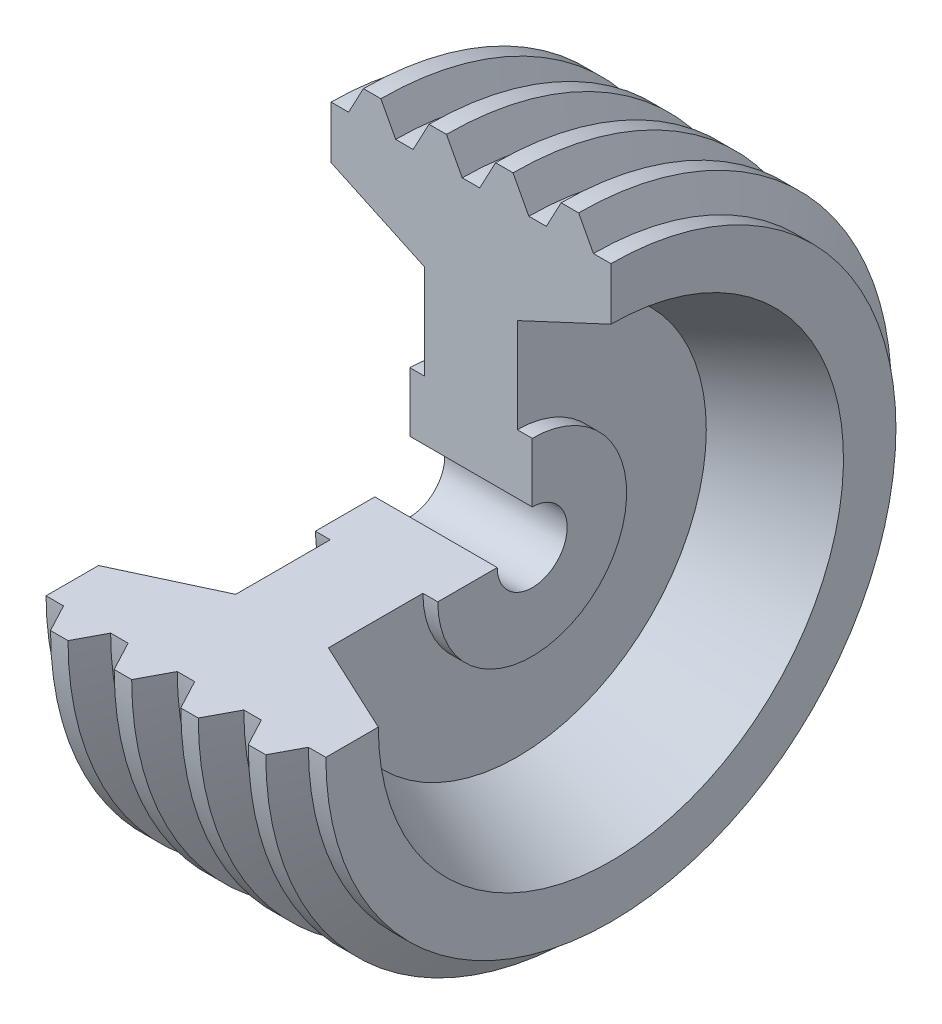
ISO-10303-21;
HEADER;
FILE_DESCRIPTION(('STEP AP214'),'2;1');
FILE_NAME('part.step','',(''),(''),'','','');
FILE_SCHEMA(('AUTOMOTIVE_DESIGN { 1 0 10303 214 1 1 1 1 }'));
ENDSEC;
DATA;
#1=APPLICATION_CONTEXT('core data for automotive mechanical design processes');
#2=APPLICATION_PROTOCOL_DEFINITION('international standard','automotive_design',2000,#1);
#3=PRODUCT_CONTEXT('',#1,'mechanical');
#4=PRODUCT('Part','Part','',(#3));
#5=PRODUCT_RELATED_PRODUCT_CATEGORY('part','',(#4));
#6=PRODUCT_DEFINITION_FORMATION('','',#4);
#7=PRODUCT_DEFINITION_CONTEXT('part definition',#1,'design');
#8=PRODUCT_DEFINITION('design','',#6,#7);
#9=PRODUCT_DEFINITION_SHAPE('','',#8);
#10=(LENGTH_UNIT() NAMED_UNIT(*) SI_UNIT(.MILLI.,.METRE.));
#11=(NAMED_UNIT(*) PLANE_ANGLE_UNIT() SI_UNIT($,.RADIAN.));
#12=(NAMED_UNIT(*) SI_UNIT($,.STERADIAN.) SOLID_ANGLE_UNIT());
#13=UNCERTAINTY_MEASURE_WITH_UNIT(LENGTH_MEASURE(1.E-05),#10,'distance_accuracy_value','');
#14=(GEOMETRIC_REPRESENTATION_CONTEXT(3) GLOBAL_UNCERTAINTY_ASSIGNED_CONTEXT((#13)) GLOBAL_UNIT_ASSIGNED_CONTEXT((#10,
#11,#12)) REPRESENTATION_CONTEXT('',''));
#15=CARTESIAN_POINT('',(0.,0.,0.));
#16=DIRECTION('',(0.,0.,1.));
#17=DIRECTION('',(1.,0.,0.));
#18=AXIS2_PLACEMENT_3D('',#15,#16,#17);
#19=CARTESIAN_POINT('',(889.,5.32101756039693E-12,508.));
#20=DIRECTION('',(1.,0.,0.));
#21=DIRECTION('',(0.,0.,-1.));
#22=AXIS2_PLACEMENT_3D('',#19,#20,#21);
#23=PLANE('',#22);
#24=CARTESIAN_POINT('',(889.,0.,0.));
#25=DIRECTION('',(1.,0.,0.));
#26=DIRECTION('',(0.,0.,-1.));
#27=AXIS2_PLACEMENT_3D('',#24,#25,#26);
#28=CIRCLE('',#27,508.);
#29=CARTESIAN_POINT('',(889.,5.32101756039693E-12,508.));
#30=VERTEX_POINT('',#29);
#31=CARTESIAN_POINT('',(889.,508.,0.));
#32=VERTEX_POINT('',#31);
#33=EDGE_CURVE('E11',#30,#32,#28,.T.);
#34=ORIENTED_EDGE('',*,*,#33,.F.);
#35=DIRECTION('',(0.,0.,1.));
#36=VECTOR('',#35,1.);
#37=CARTESIAN_POINT('',(889.,5.32101756039693E-12,508.));
#38=LINE('',#37,#36);
#39=CARTESIAN_POINT('',(889.,1.43667474130717E-11,1371.6));
#40=VERTEX_POINT('',#39);
#41=EDGE_CURVE('E218',#30,#40,#38,.T.);
#42=ORIENTED_EDGE('',*,*,#41,.T.);
#43=CARTESIAN_POINT('',(889.,0.,0.));
#44=DIRECTION('',(1.,0.,0.));
#45=DIRECTION('',(0.,0.,-1.));
#46=AXIS2_PLACEMENT_3D('',#43,#44,#45);
#47=CIRCLE('',#46,1371.6);
#48=CARTESIAN_POINT('',(889.,1371.6,0.));
#49=VERTEX_POINT('',#48);
#50=EDGE_CURVE('E213',#40,#49,#47,.T.);
#51=ORIENTED_EDGE('',*,*,#50,.T.);
#52=DIRECTION('',(0.,1.,0.));
#53=VECTOR('',#52,1.);
#54=CARTESIAN_POINT('',(889.,508.,0.));
#55=LINE('',#54,#53);
#56=EDGE_CURVE('E216',#32,#49,#55,.T.);
#57=ORIENTED_EDGE('',*,*,#56,.F.);
#58=EDGE_LOOP('',(#34,#42,#51,#57));
#59=FACE_BOUND('',#58,.T.);
#60=ADVANCED_FACE('F33',(#59),#23,.T.);
#61=CARTESIAN_POINT('',(-2111.12129677431,0.,0.));
#62=DIRECTION('',(1.,0.,0.));
#63=DIRECTION('',(0.,0.,-1.));
#64=AXIS2_PLACEMENT_3D('',#61,#62,#63);
#65=CYLINDRICAL_SURFACE('',#64,508.);
#66=CARTESIAN_POINT('',(-889.,0.,0.));
#67=DIRECTION('',(1.,0.,0.));
#68=DIRECTION('',(0.,0.,-1.));
#69=AXIS2_PLACEMENT_3D('',#66,#67,#68);
#70=CIRCLE('',#69,508.);
#71=CARTESIAN_POINT('',(-889.,5.32101756039693E-12,508.));
#72=VERTEX_POINT('',#71);
#73=CARTESIAN_POINT('',(-889.,508.,0.));
#74=VERTEX_POINT('',#73);
#75=EDGE_CURVE('E41',#72,#74,#70,.T.);
#76=ORIENTED_EDGE('',*,*,#75,.F.);
#77=DIRECTION('',(1.,0.,0.));
#78=VECTOR('',#77,1.);
#79=CARTESIAN_POINT('',(-889.,5.32101756039693E-12,508.));
#80=LINE('',#79,#78);
#81=EDGE_CURVE('E223',#72,#30,#80,.T.);
#82=ORIENTED_EDGE('',*,*,#81,.T.);
#83=ORIENTED_EDGE('',*,*,#33,.T.);
#84=DIRECTION('',(1.,0.,0.));
#85=VECTOR('',#84,1.);
#86=CARTESIAN_POINT('',(-889.,508.,0.));
#87=LINE('',#86,#85);
#88=EDGE_CURVE('E236',#74,#32,#87,.T.);
#89=ORIENTED_EDGE('',*,*,#88,.F.);
#90=EDGE_LOOP('',(#76,#82,#83,#89));
#91=FACE_BOUND('',#90,.T.);
#92=ADVANCED_FACE('F35',(#91),#65,.F.);
#93=CARTESIAN_POINT('',(-889.,5.32101756039693E-12,508.));
#94=DIRECTION('',(-1.,0.,0.));
#95=DIRECTION('',(0.,0.,1.));
#96=AXIS2_PLACEMENT_3D('',#93,#94,#95);
#97=PLANE('',#96);
#98=CARTESIAN_POINT('',(-889.,0.,0.));
#99=DIRECTION('',(1.,0.,0.));
#100=DIRECTION('',(0.,0.,-1.));
#101=AXIS2_PLACEMENT_3D('',#98,#99,#100);
#102=CIRCLE('',#101,1371.6);
#103=CARTESIAN_POINT('',(-889.,1.43667474130717E-11,1371.6));
#104=VERTEX_POINT('',#103);
#105=CARTESIAN_POINT('',(-889.,1371.6,0.));
#106=VERTEX_POINT('',#105);
#107=EDGE_CURVE('E437',#104,#106,#102,.T.);
#108=ORIENTED_EDGE('',*,*,#107,.F.);
#109=DIRECTION('',(0.,0.,-1.));
#110=VECTOR('',#109,1.);
#111=CARTESIAN_POINT('',(-889.,5.32101756039693E-12,508.));
#112=LINE('',#111,#110);
#113=EDGE_CURVE('E387',#104,#72,#112,.T.);
#114=ORIENTED_EDGE('',*,*,#113,.T.);
#115=ORIENTED_EDGE('',*,*,#75,.T.);
#116=DIRECTION('',(0.,-1.,0.));
#117=VECTOR('',#116,1.);
#118=CARTESIAN_POINT('',(-889.,508.,0.));
#119=LINE('',#118,#117);
#120=EDGE_CURVE('E309',#106,#74,#119,.T.);
#121=ORIENTED_EDGE('',*,*,#120,.F.);
#122=EDGE_LOOP('',(#108,#114,#115,#121));
#123=FACE_BOUND('',#122,.T.);
#124=ADVANCED_FACE('F440',(#123),#97,.T.);
#125=CARTESIAN_POINT('',(-2111.12129677431,0.,0.));
#126=DIRECTION('',(1.,0.,0.));
#127=DIRECTION('',(0.,0.,-1.));
#128=AXIS2_PLACEMENT_3D('',#125,#126,#127);
#129=CYLINDRICAL_SURFACE('',#128,1371.6);
#130=CARTESIAN_POINT('',(-673.1,0.,0.));
#131=DIRECTION('',(1.,0.,0.));
#132=DIRECTION('',(0.,0.,-1.));
#133=AXIS2_PLACEMENT_3D('',#130,#131,#132);
#134=CIRCLE('',#133,1371.6);
#135=CARTESIAN_POINT('',(-673.1,1.43667474130717E-11,1371.6));
#136=VERTEX_POINT('',#135);
#137=CARTESIAN_POINT('',(-673.1,1371.6,0.));
#138=VERTEX_POINT('',#137);
#139=EDGE_CURVE('E435',#136,#138,#134,.T.);
#140=ORIENTED_EDGE('',*,*,#139,.F.);
#141=DIRECTION('',(-1.,0.,0.));
#142=VECTOR('',#141,1.);
#143=CARTESIAN_POINT('',(-673.1,1.43667474130717E-11,1371.6));
#144=LINE('',#143,#142);
#145=EDGE_CURVE('E384',#136,#104,#144,.T.);
#146=ORIENTED_EDGE('',*,*,#145,.T.);
#147=ORIENTED_EDGE('',*,*,#107,.T.);
#148=DIRECTION('',(-1.,0.,0.));
#149=VECTOR('',#148,1.);
#150=CARTESIAN_POINT('',(-673.1,1371.6,0.));
#151=LINE('',#150,#149);
#152=EDGE_CURVE('E306',#138,#106,#151,.T.);
#153=ORIENTED_EDGE('',*,*,#152,.F.);
#154=EDGE_LOOP('',(#140,#146,#147,#153));
#155=FACE_BOUND('',#154,.T.);
#156=ADVANCED_FACE('F539',(#155),#129,.T.);
#157=CARTESIAN_POINT('',(-673.1,1.43667474130717E-11,1371.6));
#158=DIRECTION('',(-1.,0.,0.));
#159=DIRECTION('',(0.,0.,1.));
#160=AXIS2_PLACEMENT_3D('',#157,#158,#159);
#161=PLANE('',#160);
#162=CARTESIAN_POINT('',(-673.1,0.,0.));
#163=DIRECTION('',(1.,0.,0.));
#164=DIRECTION('',(0.,0.,-1.));
#165=AXIS2_PLACEMENT_3D('',#162,#163,#164);
#166=CIRCLE('',#165,2744.53452333316);
#167=CARTESIAN_POINT('',(-673.1,2.87474732160854E-11,2744.53452333316));
#168=VERTEX_POINT('',#167);
#169=CARTESIAN_POINT('',(-673.1,2744.53452333316,0.));
#170=VERTEX_POINT('',#169);
#171=EDGE_CURVE('E433',#168,#170,#166,.T.);
#172=ORIENTED_EDGE('',*,*,#171,.F.);
#173=DIRECTION('',(0.,0.,-1.));
#174=VECTOR('',#173,1.);
#175=CARTESIAN_POINT('',(-673.1,1.43667474130717E-11,1371.6));
#176=LINE('',#175,#174);
#177=EDGE_CURVE('E381',#168,#136,#176,.T.);
#178=ORIENTED_EDGE('',*,*,#177,.T.);
#179=ORIENTED_EDGE('',*,*,#139,.T.);
#180=DIRECTION('',(0.,-1.,0.));
#181=VECTOR('',#180,1.);
#182=CARTESIAN_POINT('',(-673.1,1371.6,0.));
#183=LINE('',#182,#181);
#184=EDGE_CURVE('E303',#170,#138,#183,.T.);
#185=ORIENTED_EDGE('',*,*,#184,.F.);
#186=EDGE_LOOP('',(#172,#178,#179,#185));
#187=FACE_BOUND('',#186,.T.);
#188=ADVANCED_FACE('F536',(#187),#161,.T.);
#189=CARTESIAN_POINT('',(-2032.,0.,0.));
#190=DIRECTION('',(-1.,0.,0.));
#191=DIRECTION('',(0.,0.,1.));
#192=AXIS2_PLACEMENT_3D('',#189,#190,#191);
#193=CONICAL_SURFACE('',#192,3378.2,0.436332312998587);
#194=CARTESIAN_POINT('',(-2032.,0.,0.));
#195=DIRECTION('',(1.,0.,0.));
#196=DIRECTION('',(0.,0.,-1.));
#197=AXIS2_PLACEMENT_3D('',#194,#195,#196);
#198=CIRCLE('',#197,3378.2);
#199=CARTESIAN_POINT('',(-2032.,3.53847667766396E-11,3378.2));
#200=VERTEX_POINT('',#199);
#201=CARTESIAN_POINT('',(-2032.,3378.2,0.));
#202=VERTEX_POINT('',#201);
#203=EDGE_CURVE('E431',#200,#202,#198,.T.);
#204=ORIENTED_EDGE('',*,*,#203,.F.);
#205=DIRECTION('',(0.906307787036648,0.,-0.422618261740704));
#206=VECTOR('',#205,1.);
#207=CARTESIAN_POINT('',(-2032.,3.53847667766396E-11,3378.2));
#208=LINE('',#207,#206);
#209=EDGE_CURVE('E378',#200,#168,#208,.T.);
#210=ORIENTED_EDGE('',*,*,#209,.T.);
#211=ORIENTED_EDGE('',*,*,#171,.T.);
#212=DIRECTION('',(0.906307787036648,-0.422618261740704,0.));
#213=VECTOR('',#212,1.);
#214=CARTESIAN_POINT('',(-2032.,3378.2,0.));
#215=LINE('',#214,#213);
#216=EDGE_CURVE('E300',#202,#170,#215,.T.);
#217=ORIENTED_EDGE('',*,*,#216,.F.);
#218=EDGE_LOOP('',(#204,#210,#211,#217));
#219=FACE_BOUND('',#218,.T.);
#220=ADVANCED_FACE('F533',(#219),#193,.F.);
#221=CARTESIAN_POINT('',(-2032.,4.3366293117235E-11,4140.2));
#222=DIRECTION('',(-1.,0.,0.));
#223=DIRECTION('',(0.,0.,1.));
#224=AXIS2_PLACEMENT_3D('',#221,#222,#223);
#225=PLANE('',#224);
#226=CARTESIAN_POINT('',(-2032.,0.,0.));
#227=DIRECTION('',(1.,0.,0.));
#228=DIRECTION('',(0.,0.,-1.));
#229=AXIS2_PLACEMENT_3D('',#226,#227,#228);
#230=CIRCLE('',#229,4140.2);
#231=CARTESIAN_POINT('',(-2032.,4.3366293117235E-11,4140.2));
#232=VERTEX_POINT('',#231);
#233=CARTESIAN_POINT('',(-2032.,4140.2,0.));
#234=VERTEX_POINT('',#233);
#235=EDGE_CURVE('E429',#232,#234,#230,.T.);
#236=ORIENTED_EDGE('',*,*,#235,.F.);
#237=DIRECTION('',(0.,0.,-1.));
#238=VECTOR('',#237,1.);
#239=CARTESIAN_POINT('',(-2032.,4.3366293117235E-11,4140.2));
#240=LINE('',#239,#238);
#241=EDGE_CURVE('E375',#232,#200,#240,.T.);
#242=ORIENTED_EDGE('',*,*,#241,.T.);
#243=ORIENTED_EDGE('',*,*,#203,.T.);
#244=DIRECTION('',(0.,-1.,0.));
#245=VECTOR('',#244,1.);
#246=CARTESIAN_POINT('',(-2032.,4140.2,0.));
#247=LINE('',#246,#245);
#248=EDGE_CURVE('E297',#234,#202,#247,.T.);
#249=ORIENTED_EDGE('',*,*,#248,.F.);
#250=EDGE_LOOP('',(#236,#242,#243,#249));
#251=FACE_BOUND('',#250,.T.);
#252=ADVANCED_FACE('F528',(#251),#225,.T.);
#253=CARTESIAN_POINT('',(-2111.12129677431,0.,0.));
#254=DIRECTION('',(1.,0.,0.));
#255=DIRECTION('',(0.,0.,-1.));
#256=AXIS2_PLACEMENT_3D('',#253,#254,#255);
#257=CYLINDRICAL_SURFACE('',#256,4140.2);
#258=CARTESIAN_POINT('',(-1778.,0.,0.));
#259=DIRECTION('',(1.,0.,0.));
#260=DIRECTION('',(0.,0.,-1.));
#261=AXIS2_PLACEMENT_3D('',#258,#259,#260);
#262=CIRCLE('',#261,4140.2);
#263=CARTESIAN_POINT('',(-1778.,4.3366293117235E-11,4140.2));
#264=VERTEX_POINT('',#263);
#265=CARTESIAN_POINT('',(-1778.,4140.2,0.));
#266=VERTEX_POINT('',#265);
#267=EDGE_CURVE('E427',#264,#266,#262,.T.);
#268=ORIENTED_EDGE('',*,*,#267,.F.);
#269=DIRECTION('',(-1.,0.,0.));
#270=VECTOR('',#269,1.);
#271=CARTESIAN_POINT('',(-1778.,4.3366293117235E-11,4140.2));
#272=LINE('',#271,#270);
#273=EDGE_CURVE('E372',#264,#232,#272,.T.);
#274=ORIENTED_EDGE('',*,*,#273,.T.);
#275=ORIENTED_EDGE('',*,*,#235,.T.);
#276=DIRECTION('',(-1.,0.,0.));
#277=VECTOR('',#276,1.);
#278=CARTESIAN_POINT('',(-1778.,4140.2,0.));
#279=LINE('',#278,#277);
#280=EDGE_CURVE('E294',#266,#234,#279,.T.);
#281=ORIENTED_EDGE('',*,*,#280,.F.);
#282=EDGE_LOOP('',(#268,#274,#275,#281));
#283=FACE_BOUND('',#282,.T.);
#284=ADVANCED_FACE('F525',(#283),#257,.T.);
#285=CARTESIAN_POINT('',(-1563.09213259143,0.,0.));
#286=DIRECTION('',(1.,0.,0.));
#287=DIRECTION('',(0.,0.,-1.));
#288=AXIS2_PLACEMENT_3D('',#285,#286,#287);
#289=CONICAL_SURFACE('',#288,4544.38291384645,1.08210413623649);
#290=CARTESIAN_POINT('',(-1563.09213259143,0.,0.));
#291=DIRECTION('',(1.,0.,0.));
#292=DIRECTION('',(0.,0.,-1.));
#293=AXIS2_PLACEMENT_3D('',#290,#291,#292);
#294=CIRCLE('',#293,4544.38291384645);
#295=CARTESIAN_POINT('',(-1563.09213259143,4.75998844207574E-11,4544.38291384645));
#296=VERTEX_POINT('',#295);
#297=CARTESIAN_POINT('',(-1563.09213259143,4544.38291384645,0.));
#298=VERTEX_POINT('',#297);
#299=EDGE_CURVE('E425',#296,#298,#294,.T.);
#300=ORIENTED_EDGE('',*,*,#299,.F.);
#301=DIRECTION('',(-0.46947156278589,0.,-0.882947592858927));
#302=VECTOR('',#301,1.);
#303=CARTESIAN_POINT('',(-1563.09213259143,4.75998844207574E-11,4544.38291384645));
#304=LINE('',#303,#302);
#305=EDGE_CURVE('E369',#296,#264,#304,.T.);
#306=ORIENTED_EDGE('',*,*,#305,.T.);
#307=ORIENTED_EDGE('',*,*,#267,.T.);
#308=DIRECTION('',(-0.46947156278589,-0.882947592858927,0.));
#309=VECTOR('',#308,1.);
#310=CARTESIAN_POINT('',(-1563.09213259143,4544.38291384645,0.));
#311=LINE('',#310,#309);
#312=EDGE_CURVE('E291',#298,#266,#311,.T.);
#313=ORIENTED_EDGE('',*,*,#312,.F.);
#314=EDGE_LOOP('',(#300,#306,#307,#313));
#315=FACE_BOUND('',#314,.T.);
#316=ADVANCED_FACE('F520',(#315),#289,.T.);
#317=CARTESIAN_POINT('',(-2111.12129677431,0.,0.));
#318=DIRECTION('',(1.,0.,0.));
#319=DIRECTION('',(0.,0.,-1.));
#320=AXIS2_PLACEMENT_3D('',#317,#318,#319);
#321=CYLINDRICAL_SURFACE('',#320,4544.38291384645);
#322=CARTESIAN_POINT('',(-1309.09213259142,0.,0.));
#323=DIRECTION('',(1.,0.,0.));
#324=DIRECTION('',(0.,0.,-1.));
#325=AXIS2_PLACEMENT_3D('',#322,#323,#324);
#326=CIRCLE('',#325,4544.38291384645);
#327=CARTESIAN_POINT('',(-1309.09213259142,4.75998844207574E-11,4544.38291384645));
#328=VERTEX_POINT('',#327);
#329=CARTESIAN_POINT('',(-1309.09213259142,4544.38291384645,0.));
#330=VERTEX_POINT('',#329);
#331=EDGE_CURVE('E423',#328,#330,#326,.T.);
#332=ORIENTED_EDGE('',*,*,#331,.F.);
#333=DIRECTION('',(-1.,0.,0.));
#334=VECTOR('',#333,1.);
#335=CARTESIAN_POINT('',(-1309.09213259142,4.75998844207574E-11,4544.38291384645));
#336=LINE('',#335,#334);
#337=EDGE_CURVE('E366',#328,#296,#336,.T.);
#338=ORIENTED_EDGE('',*,*,#337,.T.);
#339=ORIENTED_EDGE('',*,*,#299,.T.);
#340=DIRECTION('',(-1.,0.,0.));
#341=VECTOR('',#340,1.);
#342=CARTESIAN_POINT('',(-1309.09213259142,4544.38291384645,0.));
#343=LINE('',#342,#341);
#344=EDGE_CURVE('E288',#330,#298,#343,.T.);
#345=ORIENTED_EDGE('',*,*,#344,.F.);
#346=EDGE_LOOP('',(#332,#338,#339,#345));
#347=FACE_BOUND('',#346,.T.);
#348=ADVANCED_FACE('F517',(#347),#321,.T.);
#349=CARTESIAN_POINT('',(-1094.18426518285,0.,0.));
#350=DIRECTION('',(-1.,0.,0.));
#351=DIRECTION('',(0.,0.,1.));
#352=AXIS2_PLACEMENT_3D('',#349,#350,#351);
#353=CONICAL_SURFACE('',#352,4140.2,1.08210413623649);
#354=CARTESIAN_POINT('',(-1094.18426518285,0.,0.));
#355=DIRECTION('',(1.,0.,0.));
#356=DIRECTION('',(0.,0.,-1.));
#357=AXIS2_PLACEMENT_3D('',#354,#355,#356);
#358=CIRCLE('',#357,4140.2);
#359=CARTESIAN_POINT('',(-1094.18426518285,4.3366293117235E-11,4140.2));
#360=VERTEX_POINT('',#359);
#361=CARTESIAN_POINT('',(-1094.18426518285,4140.2,0.));
#362=VERTEX_POINT('',#361);
#363=EDGE_CURVE('E421',#360,#362,#358,.T.);
#364=ORIENTED_EDGE('',*,*,#363,.F.);
#365=DIRECTION('',(-0.469471562785889,0.,0.882947592858928));
#366=VECTOR('',#365,1.);
#367=CARTESIAN_POINT('',(-1094.18426518285,4.3366293117235E-11,4140.2));
#368=LINE('',#367,#366);
#369=EDGE_CURVE('E363',#360,#328,#368,.T.);
#370=ORIENTED_EDGE('',*,*,#369,.T.);
#371=ORIENTED_EDGE('',*,*,#331,.T.);
#372=DIRECTION('',(-0.469471562785889,0.882947592858928,0.));
#373=VECTOR('',#372,1.);
#374=CARTESIAN_POINT('',(-1094.18426518285,4140.2,0.));
#375=LINE('',#374,#373);
#376=EDGE_CURVE('E285',#362,#330,#375,.T.);
#377=ORIENTED_EDGE('',*,*,#376,.F.);
#378=EDGE_LOOP('',(#364,#370,#371,#377));
#379=FACE_BOUND('',#378,.T.);
#380=ADVANCED_FACE('F512',(#379),#353,.T.);
#381=CARTESIAN_POINT('',(-2111.12129677431,0.,0.));
#382=DIRECTION('',(1.,0.,0.));
#383=DIRECTION('',(0.,0.,-1.));
#384=AXIS2_PLACEMENT_3D('',#381,#382,#383);
#385=CYLINDRICAL_SURFACE('',#384,4140.2);
#386=CARTESIAN_POINT('',(-840.184265182851,0.,0.));
#387=DIRECTION('',(1.,0.,0.));
#388=DIRECTION('',(0.,0.,-1.));
#389=AXIS2_PLACEMENT_3D('',#386,#387,#388);
#390=CIRCLE('',#389,4140.2);
#391=CARTESIAN_POINT('',(-840.184265182851,4.3366293117235E-11,4140.2));
#392=VERTEX_POINT('',#391);
#393=CARTESIAN_POINT('',(-840.184265182851,4140.2,0.));
#394=VERTEX_POINT('',#393);
#395=EDGE_CURVE('E419',#392,#394,#390,.T.);
#396=ORIENTED_EDGE('',*,*,#395,.F.);
#397=DIRECTION('',(-1.,0.,0.));
#398=VECTOR('',#397,1.);
#399=CARTESIAN_POINT('',(-840.184265182851,4.3366293117235E-11,4140.2));
#400=LINE('',#399,#398);
#401=EDGE_CURVE('E360',#392,#360,#400,.T.);
#402=ORIENTED_EDGE('',*,*,#401,.T.);
#403=ORIENTED_EDGE('',*,*,#363,.T.);
#404=DIRECTION('',(-1.,0.,0.));
#405=VECTOR('',#404,1.);
#406=CARTESIAN_POINT('',(-840.184265182851,4140.2,0.));
#407=LINE('',#406,#405);
#408=EDGE_CURVE('E282',#394,#362,#407,.T.);
#409=ORIENTED_EDGE('',*,*,#408,.F.);
#410=EDGE_LOOP('',(#396,#402,#403,#409));
#411=FACE_BOUND('',#410,.T.);
#412=ADVANCED_FACE('F509',(#411),#385,.T.);
#413=CARTESIAN_POINT('',(-610.592132591425,0.,0.));
#414=DIRECTION('',(1.,0.,0.));
#415=DIRECTION('',(0.,0.,-1.));
#416=AXIS2_PLACEMENT_3D('',#413,#414,#415);
#417=CONICAL_SURFACE('',#416,4572.,1.08210413623649);
#418=CARTESIAN_POINT('',(-610.592132591425,0.,0.));
#419=DIRECTION('',(1.,0.,0.));
#420=DIRECTION('',(0.,0.,-1.));
#421=AXIS2_PLACEMENT_3D('',#418,#419,#420);
#422=CIRCLE('',#421,4572.);
#423=CARTESIAN_POINT('',(-610.592132591425,4.78891580435724E-11,4572.));
#424=VERTEX_POINT('',#423);
#425=CARTESIAN_POINT('',(-610.592132591425,4572.,0.));
#426=VERTEX_POINT('',#425);
#427=EDGE_CURVE('E417',#424,#426,#422,.T.);
#428=ORIENTED_EDGE('',*,*,#427,.F.);
#429=DIRECTION('',(-0.469471562785889,0.,-0.882947592858928));
#430=VECTOR('',#429,1.);
#431=CARTESIAN_POINT('',(-610.592132591425,4.78891580435724E-11,4572.));
#432=LINE('',#431,#430);
#433=EDGE_CURVE('E357',#424,#392,#432,.T.);
#434=ORIENTED_EDGE('',*,*,#433,.T.);
#435=ORIENTED_EDGE('',*,*,#395,.T.);
#436=DIRECTION('',(-0.469471562785889,-0.882947592858928,0.));
#437=VECTOR('',#436,1.);
#438=CARTESIAN_POINT('',(-610.592132591425,4572.,0.));
#439=LINE('',#438,#437);
#440=EDGE_CURVE('E279',#426,#394,#439,.T.);
#441=ORIENTED_EDGE('',*,*,#440,.F.);
#442=EDGE_LOOP('',(#428,#434,#435,#441));
#443=FACE_BOUND('',#442,.T.);
#444=ADVANCED_FACE('F504',(#443),#417,.T.);
#445=CARTESIAN_POINT('',(-2111.12129677431,0.,0.));
#446=DIRECTION('',(1.,0.,0.));
#447=DIRECTION('',(0.,0.,-1.));
#448=AXIS2_PLACEMENT_3D('',#445,#446,#447);
#449=CYLINDRICAL_SURFACE('',#448,4572.);
#450=CARTESIAN_POINT('',(-356.592132591425,0.,0.));
#451=DIRECTION('',(1.,0.,0.));
#452=DIRECTION('',(0.,0.,-1.));
#453=AXIS2_PLACEMENT_3D('',#450,#451,#452);
#454=CIRCLE('',#453,4572.);
#455=CARTESIAN_POINT('',(-356.592132591425,4.78891580435724E-11,4572.));
#456=VERTEX_POINT('',#455);
#457=CARTESIAN_POINT('',(-356.592132591425,4572.,0.));
#458=VERTEX_POINT('',#457);
#459=EDGE_CURVE('E415',#456,#458,#454,.T.);
#460=ORIENTED_EDGE('',*,*,#459,.F.);
#461=DIRECTION('',(-1.,0.,0.));
#462=VECTOR('',#461,1.);
#463=CARTESIAN_POINT('',(-356.592132591425,4.78891580435724E-11,4572.));
#464=LINE('',#463,#462);
#465=EDGE_CURVE('E354',#456,#424,#464,.T.);
#466=ORIENTED_EDGE('',*,*,#465,.T.);
#467=ORIENTED_EDGE('',*,*,#427,.T.);
#468=DIRECTION('',(-1.,0.,0.));
#469=VECTOR('',#468,1.);
#470=CARTESIAN_POINT('',(-356.592132591425,4572.,0.));
#471=LINE('',#470,#469);
#472=EDGE_CURVE('E276',#458,#426,#471,.T.);
#473=ORIENTED_EDGE('',*,*,#472,.F.);
#474=EDGE_LOOP('',(#460,#466,#467,#473));
#475=FACE_BOUND('',#474,.T.);
#476=ADVANCED_FACE('F501',(#475),#449,.T.);
#477=CARTESIAN_POINT('',(-127.,0.,0.));
#478=DIRECTION('',(-1.,0.,0.));
#479=DIRECTION('',(0.,0.,1.));
#480=AXIS2_PLACEMENT_3D('',#477,#478,#479);
#481=CONICAL_SURFACE('',#480,4140.2,1.08210413623649);
#482=CARTESIAN_POINT('',(-127.,0.,0.));
#483=DIRECTION('',(1.,0.,0.));
#484=DIRECTION('',(0.,0.,-1.));
#485=AXIS2_PLACEMENT_3D('',#482,#483,#484);
#486=CIRCLE('',#485,4140.2);
#487=CARTESIAN_POINT('',(-127.,4.3366293117235E-11,4140.2));
#488=VERTEX_POINT('',#487);
#489=CARTESIAN_POINT('',(-127.,4140.2,0.));
#490=VERTEX_POINT('',#489);
#491=EDGE_CURVE('E413',#488,#490,#486,.T.);
#492=ORIENTED_EDGE('',*,*,#491,.F.);
#493=DIRECTION('',(-0.469471562785889,0.,0.882947592858928));
#494=VECTOR('',#493,1.);
#495=CARTESIAN_POINT('',(-127.,4.3366293117235E-11,4140.2));
#496=LINE('',#495,#494);
#497=EDGE_CURVE('E351',#488,#456,#496,.T.);
#498=ORIENTED_EDGE('',*,*,#497,.T.);
#499=ORIENTED_EDGE('',*,*,#459,.T.);
#500=DIRECTION('',(-0.469471562785889,0.882947592858928,0.));
#501=VECTOR('',#500,1.);
#502=CARTESIAN_POINT('',(-127.,4140.2,0.));
#503=LINE('',#502,#501);
#504=EDGE_CURVE('E273',#490,#458,#503,.T.);
#505=ORIENTED_EDGE('',*,*,#504,.F.);
#506=EDGE_LOOP('',(#492,#498,#499,#505));
#507=FACE_BOUND('',#506,.T.);
#508=ADVANCED_FACE('F496',(#507),#481,.T.);
#509=CARTESIAN_POINT('',(-2111.12129677431,0.,0.));
#510=DIRECTION('',(1.,0.,0.));
#511=DIRECTION('',(0.,0.,-1.));
#512=AXIS2_PLACEMENT_3D('',#509,#510,#511);
#513=CYLINDRICAL_SURFACE('',#512,4140.2);
#514=CARTESIAN_POINT('',(127.,0.,0.));
#515=DIRECTION('',(1.,0.,0.));
#516=DIRECTION('',(0.,0.,-1.));
#517=AXIS2_PLACEMENT_3D('',#514,#515,#516);
#518=CIRCLE('',#517,4140.2);
#519=CARTESIAN_POINT('',(127.,4.3366293117235E-11,4140.2));
#520=VERTEX_POINT('',#519);
#521=CARTESIAN_POINT('',(127.,4140.2,0.));
#522=VERTEX_POINT('',#521);
#523=EDGE_CURVE('E411',#520,#522,#518,.T.);
#524=ORIENTED_EDGE('',*,*,#523,.F.);
#525=DIRECTION('',(-1.,0.,0.));
#526=VECTOR('',#525,1.);
#527=CARTESIAN_POINT('',(-127.,4.3366293117235E-11,4140.2));
#528=LINE('',#527,#526);
#529=EDGE_CURVE('E348',#520,#488,#528,.T.);
#530=ORIENTED_EDGE('',*,*,#529,.T.);
#531=ORIENTED_EDGE('',*,*,#491,.T.);
#532=DIRECTION('',(-1.,0.,0.));
#533=VECTOR('',#532,1.);
#534=CARTESIAN_POINT('',(-127.,4140.2,0.));
#535=LINE('',#534,#533);
#536=EDGE_CURVE('E270',#522,#490,#535,.T.);
#537=ORIENTED_EDGE('',*,*,#536,.F.);
#538=EDGE_LOOP('',(#524,#530,#531,#537));
#539=FACE_BOUND('',#538,.T.);
#540=ADVANCED_FACE('F493',(#539),#513,.T.);
#541=CARTESIAN_POINT('',(356.592132591425,0.,0.));
#542=DIRECTION('',(1.,0.,0.));
#543=DIRECTION('',(0.,0.,-1.));
#544=AXIS2_PLACEMENT_3D('',#541,#542,#543);
#545=CONICAL_SURFACE('',#544,4572.,1.08210413623649);
#546=CARTESIAN_POINT('',(356.592132591425,0.,0.));
#547=DIRECTION('',(1.,0.,0.));
#548=DIRECTION('',(0.,0.,-1.));
#549=AXIS2_PLACEMENT_3D('',#546,#547,#548);
#550=CIRCLE('',#549,4572.);
#551=CARTESIAN_POINT('',(356.592132591425,4.78891580435724E-11,4572.));
#552=VERTEX_POINT('',#551);
#553=CARTESIAN_POINT('',(356.592132591425,4572.,0.));
#554=VERTEX_POINT('',#553);
#555=EDGE_CURVE('E409',#552,#554,#550,.T.);
#556=ORIENTED_EDGE('',*,*,#555,.F.);
#557=DIRECTION('',(-0.469471562785889,0.,-0.882947592858928));
#558=VECTOR('',#557,1.);
#559=CARTESIAN_POINT('',(127.,4.3366293117235E-11,4140.2));
#560=LINE('',#559,#558);
#561=EDGE_CURVE('E345',#552,#520,#560,.T.);
#562=ORIENTED_EDGE('',*,*,#561,.T.);
#563=ORIENTED_EDGE('',*,*,#523,.T.);
#564=DIRECTION('',(-0.469471562785889,-0.882947592858928,0.));
#565=VECTOR('',#564,1.);
#566=CARTESIAN_POINT('',(127.,4140.2,0.));
#567=LINE('',#566,#565);
#568=EDGE_CURVE('E267',#554,#522,#567,.T.);
#569=ORIENTED_EDGE('',*,*,#568,.F.);
#570=EDGE_LOOP('',(#556,#562,#563,#569));
#571=FACE_BOUND('',#570,.T.);
#572=ADVANCED_FACE('F488',(#571),#545,.T.);
#573=CARTESIAN_POINT('',(-2111.12129677431,0.,0.));
#574=DIRECTION('',(1.,0.,0.));
#575=DIRECTION('',(0.,0.,-1.));
#576=AXIS2_PLACEMENT_3D('',#573,#574,#575);
#577=CYLINDRICAL_SURFACE('',#576,4572.);
#578=CARTESIAN_POINT('',(610.592132591425,0.,0.));
#579=DIRECTION('',(1.,0.,0.));
#580=DIRECTION('',(0.,0.,-1.));
#581=AXIS2_PLACEMENT_3D('',#578,#579,#580);
#582=CIRCLE('',#581,4572.);
#583=CARTESIAN_POINT('',(610.592132591425,4.78891580435724E-11,4572.));
#584=VERTEX_POINT('',#583);
#585=CARTESIAN_POINT('',(610.592132591425,4572.,0.));
#586=VERTEX_POINT('',#585);
#587=EDGE_CURVE('E407',#584,#586,#582,.T.);
#588=ORIENTED_EDGE('',*,*,#587,.F.);
#589=DIRECTION('',(-1.,0.,0.));
#590=VECTOR('',#589,1.);
#591=CARTESIAN_POINT('',(356.592132591425,4.78891580435724E-11,4572.));
#592=LINE('',#591,#590);
#593=EDGE_CURVE('E342',#584,#552,#592,.T.);
#594=ORIENTED_EDGE('',*,*,#593,.T.);
#595=ORIENTED_EDGE('',*,*,#555,.T.);
#596=DIRECTION('',(-1.,0.,0.));
#597=VECTOR('',#596,1.);
#598=CARTESIAN_POINT('',(356.592132591425,4572.,0.));
#599=LINE('',#598,#597);
#600=EDGE_CURVE('E264',#586,#554,#599,.T.);
#601=ORIENTED_EDGE('',*,*,#600,.F.);
#602=EDGE_LOOP('',(#588,#594,#595,#601));
#603=FACE_BOUND('',#602,.T.);
#604=ADVANCED_FACE('F485',(#603),#577,.T.);
#605=CARTESIAN_POINT('',(840.184265182851,0.,0.));
#606=DIRECTION('',(-1.,0.,0.));
#607=DIRECTION('',(0.,0.,1.));
#608=AXIS2_PLACEMENT_3D('',#605,#606,#607);
#609=CONICAL_SURFACE('',#608,4140.2,1.08210413623649);
#610=CARTESIAN_POINT('',(840.184265182851,0.,0.));
#611=DIRECTION('',(1.,0.,0.));
#612=DIRECTION('',(0.,0.,-1.));
#613=AXIS2_PLACEMENT_3D('',#610,#611,#612);
#614=CIRCLE('',#613,4140.2);
#615=CARTESIAN_POINT('',(840.184265182851,4.3366293117235E-11,4140.2));
#616=VERTEX_POINT('',#615);
#617=CARTESIAN_POINT('',(840.184265182851,4140.2,0.));
#618=VERTEX_POINT('',#617);
#619=EDGE_CURVE('E405',#616,#618,#614,.T.);
#620=ORIENTED_EDGE('',*,*,#619,.F.);
#621=DIRECTION('',(-0.469471562785889,0.,0.882947592858928));
#622=VECTOR('',#621,1.);
#623=CARTESIAN_POINT('',(610.592132591425,4.78891580435724E-11,4572.));
#624=LINE('',#623,#622);
#625=EDGE_CURVE('E339',#616,#584,#624,.T.);
#626=ORIENTED_EDGE('',*,*,#625,.T.);
#627=ORIENTED_EDGE('',*,*,#587,.T.);
#628=DIRECTION('',(-0.469471562785889,0.882947592858928,0.));
#629=VECTOR('',#628,1.);
#630=CARTESIAN_POINT('',(610.592132591425,4572.,0.));
#631=LINE('',#630,#629);
#632=EDGE_CURVE('E261',#618,#586,#631,.T.);
#633=ORIENTED_EDGE('',*,*,#632,.F.);
#634=EDGE_LOOP('',(#620,#626,#627,#633));
#635=FACE_BOUND('',#634,.T.);
#636=ADVANCED_FACE('F480',(#635),#609,.T.);
#637=CARTESIAN_POINT('',(-2111.12129677431,0.,0.));
#638=DIRECTION('',(1.,0.,0.));
#639=DIRECTION('',(0.,0.,-1.));
#640=AXIS2_PLACEMENT_3D('',#637,#638,#639);
#641=CYLINDRICAL_SURFACE('',#640,4140.2);
#642=CARTESIAN_POINT('',(1094.18426518285,0.,0.));
#643=DIRECTION('',(1.,0.,0.));
#644=DIRECTION('',(0.,0.,-1.));
#645=AXIS2_PLACEMENT_3D('',#642,#643,#644);
#646=CIRCLE('',#645,4140.2);
#647=CARTESIAN_POINT('',(1094.18426518285,4.3366293117235E-11,4140.2));
#648=VERTEX_POINT('',#647);
#649=CARTESIAN_POINT('',(1094.18426518285,4140.2,0.));
#650=VERTEX_POINT('',#649);
#651=EDGE_CURVE('E403',#648,#650,#646,.T.);
#652=ORIENTED_EDGE('',*,*,#651,.F.);
#653=DIRECTION('',(-1.,0.,0.));
#654=VECTOR('',#653,1.);
#655=CARTESIAN_POINT('',(840.184265182851,4.3366293117235E-11,4140.2));
#656=LINE('',#655,#654);
#657=EDGE_CURVE('E336',#648,#616,#656,.T.);
#658=ORIENTED_EDGE('',*,*,#657,.T.);
#659=ORIENTED_EDGE('',*,*,#619,.T.);
#660=DIRECTION('',(-1.,0.,0.));
#661=VECTOR('',#660,1.);
#662=CARTESIAN_POINT('',(840.184265182851,4140.2,0.));
#663=LINE('',#662,#661);
#664=EDGE_CURVE('E258',#650,#618,#663,.T.);
#665=ORIENTED_EDGE('',*,*,#664,.F.);
#666=EDGE_LOOP('',(#652,#658,#659,#665));
#667=FACE_BOUND('',#666,.T.);
#668=ADVANCED_FACE('F477',(#667),#641,.T.);
#669=CARTESIAN_POINT('',(1309.09213259142,0.,0.));
#670=DIRECTION('',(1.,0.,0.));
#671=DIRECTION('',(0.,0.,-1.));
#672=AXIS2_PLACEMENT_3D('',#669,#670,#671);
#673=CONICAL_SURFACE('',#672,4544.38291384645,1.08210413623649);
#674=CARTESIAN_POINT('',(1309.09213259142,0.,0.));
#675=DIRECTION('',(1.,0.,0.));
#676=DIRECTION('',(0.,0.,-1.));
#677=AXIS2_PLACEMENT_3D('',#674,#675,#676);
#678=CIRCLE('',#677,4544.38291384645);
#679=CARTESIAN_POINT('',(1309.09213259142,4.75998844207574E-11,4544.38291384645));
#680=VERTEX_POINT('',#679);
#681=CARTESIAN_POINT('',(1309.09213259142,4544.38291384645,0.));
#682=VERTEX_POINT('',#681);
#683=EDGE_CURVE('E401',#680,#682,#678,.T.);
#684=ORIENTED_EDGE('',*,*,#683,.F.);
#685=DIRECTION('',(-0.469471562785889,0.,-0.882947592858928));
#686=VECTOR('',#685,1.);
#687=CARTESIAN_POINT('',(1094.18426518285,4.3366293117235E-11,4140.2));
#688=LINE('',#687,#686);
#689=EDGE_CURVE('E333',#680,#648,#688,.T.);
#690=ORIENTED_EDGE('',*,*,#689,.T.);
#691=ORIENTED_EDGE('',*,*,#651,.T.);
#692=DIRECTION('',(-0.469471562785889,-0.882947592858928,0.));
#693=VECTOR('',#692,1.);
#694=CARTESIAN_POINT('',(1094.18426518285,4140.2,0.));
#695=LINE('',#694,#693);
#696=EDGE_CURVE('E255',#682,#650,#695,.T.);
#697=ORIENTED_EDGE('',*,*,#696,.F.);
#698=EDGE_LOOP('',(#684,#690,#691,#697));
#699=FACE_BOUND('',#698,.T.);
#700=ADVANCED_FACE('F472',(#699),#673,.T.);
#701=CARTESIAN_POINT('',(-2111.12129677431,0.,0.));
#702=DIRECTION('',(1.,0.,0.));
#703=DIRECTION('',(0.,0.,-1.));
#704=AXIS2_PLACEMENT_3D('',#701,#702,#703);
#705=CYLINDRICAL_SURFACE('',#704,4544.38291384645);
#706=CARTESIAN_POINT('',(1563.09213259143,0.,0.));
#707=DIRECTION('',(1.,0.,0.));
#708=DIRECTION('',(0.,0.,-1.));
#709=AXIS2_PLACEMENT_3D('',#706,#707,#708);
#710=CIRCLE('',#709,4544.38291384645);
#711=CARTESIAN_POINT('',(1563.09213259143,4.75998844207574E-11,4544.38291384645));
#712=VERTEX_POINT('',#711);
#713=CARTESIAN_POINT('',(1563.09213259143,4544.38291384645,0.));
#714=VERTEX_POINT('',#713);
#715=EDGE_CURVE('E399',#712,#714,#710,.T.);
#716=ORIENTED_EDGE('',*,*,#715,.F.);
#717=DIRECTION('',(-1.,0.,0.));
#718=VECTOR('',#717,1.);
#719=CARTESIAN_POINT('',(1309.09213259142,4.75998844207574E-11,4544.38291384645));
#720=LINE('',#719,#718);
#721=EDGE_CURVE('E330',#712,#680,#720,.T.);
#722=ORIENTED_EDGE('',*,*,#721,.T.);
#723=ORIENTED_EDGE('',*,*,#683,.T.);
#724=DIRECTION('',(-1.,0.,0.));
#725=VECTOR('',#724,1.);
#726=CARTESIAN_POINT('',(1309.09213259142,4544.38291384645,0.));
#727=LINE('',#726,#725);
#728=EDGE_CURVE('E252',#714,#682,#727,.T.);
#729=ORIENTED_EDGE('',*,*,#728,.F.);
#730=EDGE_LOOP('',(#716,#722,#723,#729));
#731=FACE_BOUND('',#730,.T.);
#732=ADVANCED_FACE('F469',(#731),#705,.T.);
#733=CARTESIAN_POINT('',(1778.,0.,0.));
#734=DIRECTION('',(-1.,0.,0.));
#735=DIRECTION('',(0.,0.,1.));
#736=AXIS2_PLACEMENT_3D('',#733,#734,#735);
#737=CONICAL_SURFACE('',#736,4140.2,1.08210413623648);
#738=CARTESIAN_POINT('',(1778.,0.,0.));
#739=DIRECTION('',(1.,0.,0.));
#740=DIRECTION('',(0.,0.,-1.));
#741=AXIS2_PLACEMENT_3D('',#738,#739,#740);
#742=CIRCLE('',#741,4140.2);
#743=CARTESIAN_POINT('',(1778.,4.3366293117235E-11,4140.2));
#744=VERTEX_POINT('',#743);
#745=CARTESIAN_POINT('',(1778.,4140.2,0.));
#746=VERTEX_POINT('',#745);
#747=EDGE_CURVE('E397',#744,#746,#742,.T.);
#748=ORIENTED_EDGE('',*,*,#747,.F.);
#749=DIRECTION('',(-0.46947156278589,0.,0.882947592858927));
#750=VECTOR('',#749,1.);
#751=CARTESIAN_POINT('',(1563.09213259143,4.75998844207574E-11,4544.38291384645));
#752=LINE('',#751,#750);
#753=EDGE_CURVE('E327',#744,#712,#752,.T.);
#754=ORIENTED_EDGE('',*,*,#753,.T.);
#755=ORIENTED_EDGE('',*,*,#715,.T.);
#756=DIRECTION('',(-0.46947156278589,0.882947592858927,0.));
#757=VECTOR('',#756,1.);
#758=CARTESIAN_POINT('',(1563.09213259143,4544.38291384645,0.));
#759=LINE('',#758,#757);
#760=EDGE_CURVE('E249',#746,#714,#759,.T.);
#761=ORIENTED_EDGE('',*,*,#760,.F.);
#762=EDGE_LOOP('',(#748,#754,#755,#761));
#763=FACE_BOUND('',#762,.T.);
#764=ADVANCED_FACE('F464',(#763),#737,.T.);
#765=CARTESIAN_POINT('',(-2111.12129677431,0.,0.));
#766=DIRECTION('',(1.,0.,0.));
#767=DIRECTION('',(0.,0.,-1.));
#768=AXIS2_PLACEMENT_3D('',#765,#766,#767);
#769=CYLINDRICAL_SURFACE('',#768,4140.2);
#770=CARTESIAN_POINT('',(2032.,0.,0.));
#771=DIRECTION('',(1.,0.,0.));
#772=DIRECTION('',(0.,0.,-1.));
#773=AXIS2_PLACEMENT_3D('',#770,#771,#772);
#774=CIRCLE('',#773,4140.2);
#775=CARTESIAN_POINT('',(2032.,4.3366293117235E-11,4140.2));
#776=VERTEX_POINT('',#775);
#777=CARTESIAN_POINT('',(2032.,4140.2,0.));
#778=VERTEX_POINT('',#777);
#779=EDGE_CURVE('E395',#776,#778,#774,.T.);
#780=ORIENTED_EDGE('',*,*,#779,.F.);
#781=DIRECTION('',(-1.,0.,0.));
#782=VECTOR('',#781,1.);
#783=CARTESIAN_POINT('',(1778.,4.3366293117235E-11,4140.2));
#784=LINE('',#783,#782);
#785=EDGE_CURVE('E324',#776,#744,#784,.T.);
#786=ORIENTED_EDGE('',*,*,#785,.T.);
#787=ORIENTED_EDGE('',*,*,#747,.T.);
#788=DIRECTION('',(-1.,0.,0.));
#789=VECTOR('',#788,1.);
#790=CARTESIAN_POINT('',(1778.,4140.2,0.));
#791=LINE('',#790,#789);
#792=EDGE_CURVE('E246',#778,#746,#791,.T.);
#793=ORIENTED_EDGE('',*,*,#792,.F.);
#794=EDGE_LOOP('',(#780,#786,#787,#793));
#795=FACE_BOUND('',#794,.T.);
#796=ADVANCED_FACE('F461',(#795),#769,.T.);
#797=CARTESIAN_POINT('',(2032.,4.3366293117235E-11,4140.2));
#798=DIRECTION('',(1.,0.,0.));
#799=DIRECTION('',(0.,0.,-1.));
#800=AXIS2_PLACEMENT_3D('',#797,#798,#799);
#801=PLANE('',#800);
#802=CARTESIAN_POINT('',(2032.,0.,0.));
#803=DIRECTION('',(1.,0.,0.));
#804=DIRECTION('',(0.,0.,-1.));
#805=AXIS2_PLACEMENT_3D('',#802,#803,#804);
#806=CIRCLE('',#805,3378.2);
#807=CARTESIAN_POINT('',(2032.,3.53847667766396E-11,3378.2));
#808=VERTEX_POINT('',#807);
#809=CARTESIAN_POINT('',(2032.,3378.2,0.));
#810=VERTEX_POINT('',#809);
#811=EDGE_CURVE('E393',#808,#810,#806,.T.);
#812=ORIENTED_EDGE('',*,*,#811,.F.);
#813=DIRECTION('',(0.,0.,1.));
#814=VECTOR('',#813,1.);
#815=CARTESIAN_POINT('',(2032.,4.3366293117235E-11,4140.2));
#816=LINE('',#815,#814);
#817=EDGE_CURVE('E321',#808,#776,#816,.T.);
#818=ORIENTED_EDGE('',*,*,#817,.T.);
#819=ORIENTED_EDGE('',*,*,#779,.T.);
#820=DIRECTION('',(0.,1.,0.));
#821=VECTOR('',#820,1.);
#822=CARTESIAN_POINT('',(2032.,4140.2,0.));
#823=LINE('',#822,#821);
#824=EDGE_CURVE('E243',#810,#778,#823,.T.);
#825=ORIENTED_EDGE('',*,*,#824,.F.);
#826=EDGE_LOOP('',(#812,#818,#819,#825));
#827=FACE_BOUND('',#826,.T.);
#828=ADVANCED_FACE('F456',(#827),#801,.T.);
#829=CARTESIAN_POINT('',(673.1,0.,0.));
#830=DIRECTION('',(1.,0.,0.));
#831=DIRECTION('',(0.,0.,-1.));
#832=AXIS2_PLACEMENT_3D('',#829,#830,#831);
#833=CONICAL_SURFACE('',#832,2744.53452333316,0.436332312998587);
#834=CARTESIAN_POINT('',(673.1,0.,0.));
#835=DIRECTION('',(1.,0.,0.));
#836=DIRECTION('',(0.,0.,-1.));
#837=AXIS2_PLACEMENT_3D('',#834,#835,#836);
#838=CIRCLE('',#837,2744.53452333316);
#839=CARTESIAN_POINT('',(673.1,2.87474732160854E-11,2744.53452333316));
#840=VERTEX_POINT('',#839);
#841=CARTESIAN_POINT('',(673.1,2744.53452333316,0.));
#842=VERTEX_POINT('',#841);
#843=EDGE_CURVE('E391',#840,#842,#838,.T.);
#844=ORIENTED_EDGE('',*,*,#843,.F.);
#845=DIRECTION('',(0.906307787036648,0.,0.422618261740704));
#846=VECTOR('',#845,1.);
#847=CARTESIAN_POINT('',(2032.,3.53847667766396E-11,3378.2));
#848=LINE('',#847,#846);
#849=EDGE_CURVE('E318',#840,#808,#848,.T.);
#850=ORIENTED_EDGE('',*,*,#849,.T.);
#851=ORIENTED_EDGE('',*,*,#811,.T.);
#852=DIRECTION('',(0.906307787036648,0.422618261740704,0.));
#853=VECTOR('',#852,1.);
#854=CARTESIAN_POINT('',(2032.,3378.2,0.));
#855=LINE('',#854,#853);
#856=EDGE_CURVE('E240',#842,#810,#855,.T.);
#857=ORIENTED_EDGE('',*,*,#856,.F.);
#858=EDGE_LOOP('',(#844,#850,#851,#857));
#859=FACE_BOUND('',#858,.T.);
#860=ADVANCED_FACE('F454',(#859),#833,.F.);
#861=CARTESIAN_POINT('',(673.1,1.43667474130717E-11,1371.6));
#862=DIRECTION('',(1.,0.,0.));
#863=DIRECTION('',(0.,0.,-1.));
#864=AXIS2_PLACEMENT_3D('',#861,#862,#863);
#865=PLANE('',#864);
#866=CARTESIAN_POINT('',(673.1,0.,0.));
#867=DIRECTION('',(1.,0.,0.));
#868=DIRECTION('',(0.,0.,-1.));
#869=AXIS2_PLACEMENT_3D('',#866,#867,#868);
#870=CIRCLE('',#869,1371.6);
#871=CARTESIAN_POINT('',(673.1,1.43667474130717E-11,1371.6));
#872=VERTEX_POINT('',#871);
#873=CARTESIAN_POINT('',(673.1,1371.6,0.));
#874=VERTEX_POINT('',#873);
#875=EDGE_CURVE('E222',#872,#874,#870,.T.);
#876=ORIENTED_EDGE('',*,*,#875,.F.);
#877=DIRECTION('',(0.,0.,1.));
#878=VECTOR('',#877,1.);
#879=CARTESIAN_POINT('',(673.1,1.43667474130717E-11,1371.6));
#880=LINE('',#879,#878);
#881=EDGE_CURVE('E315',#872,#840,#880,.T.);
#882=ORIENTED_EDGE('',*,*,#881,.T.);
#883=ORIENTED_EDGE('',*,*,#843,.T.);
#884=DIRECTION('',(0.,1.,0.));
#885=VECTOR('',#884,1.);
#886=CARTESIAN_POINT('',(673.1,1371.6,0.));
#887=LINE('',#886,#885);
#888=EDGE_CURVE('E231',#874,#842,#887,.T.);
#889=ORIENTED_EDGE('',*,*,#888,.F.);
#890=EDGE_LOOP('',(#876,#882,#883,#889));
#891=FACE_BOUND('',#890,.T.);
#892=ADVANCED_FACE('F450',(#891),#865,.T.);
#893=CARTESIAN_POINT('',(-2111.12129677431,0.,0.));
#894=DIRECTION('',(1.,0.,0.));
#895=DIRECTION('',(0.,0.,-1.));
#896=AXIS2_PLACEMENT_3D('',#893,#894,#895);
#897=CYLINDRICAL_SURFACE('',#896,1371.6);
#898=DIRECTION('',(-1.,0.,0.));
#899=VECTOR('',#898,1.);
#900=CARTESIAN_POINT('',(673.1,1.43667474130717E-11,1371.6));
#901=LINE('',#900,#899);
#902=EDGE_CURVE('E313',#40,#872,#901,.T.);
#903=ORIENTED_EDGE('',*,*,#902,.T.);
#904=ORIENTED_EDGE('',*,*,#875,.T.);
#905=DIRECTION('',(-1.,0.,0.));
#906=VECTOR('',#905,1.);
#907=CARTESIAN_POINT('',(673.1,1371.6,0.));
#908=LINE('',#907,#906);
#909=EDGE_CURVE('E226',#49,#874,#908,.T.);
#910=ORIENTED_EDGE('',*,*,#909,.F.);
#911=ORIENTED_EDGE('',*,*,#50,.F.);
#912=EDGE_LOOP('',(#903,#904,#910,#911));
#913=FACE_BOUND('',#912,.T.);
#914=ADVANCED_FACE('F227',(#913),#897,.T.);
#915=CARTESIAN_POINT('',(0.,0.,0.));
#916=DIRECTION('',(0.,1.,0.));
#917=DIRECTION('',(-1.,0.,0.));
#918=AXIS2_PLACEMENT_3D('',#915,#916,#917);
#919=PLANE('',#918);
#920=ORIENTED_EDGE('',*,*,#41,.F.);
#921=ORIENTED_EDGE('',*,*,#81,.F.);
#922=ORIENTED_EDGE('',*,*,#113,.F.);
#923=ORIENTED_EDGE('',*,*,#145,.F.);
#924=ORIENTED_EDGE('',*,*,#177,.F.);
#925=ORIENTED_EDGE('',*,*,#209,.F.);
#926=ORIENTED_EDGE('',*,*,#241,.F.);
#927=ORIENTED_EDGE('',*,*,#273,.F.);
#928=ORIENTED_EDGE('',*,*,#305,.F.);
#929=ORIENTED_EDGE('',*,*,#337,.F.);
#930=ORIENTED_EDGE('',*,*,#369,.F.);
#931=ORIENTED_EDGE('',*,*,#401,.F.);
#932=ORIENTED_EDGE('',*,*,#433,.F.);
#933=ORIENTED_EDGE('',*,*,#465,.F.);
#934=ORIENTED_EDGE('',*,*,#497,.F.);
#935=ORIENTED_EDGE('',*,*,#529,.F.);
#936=ORIENTED_EDGE('',*,*,#561,.F.);
#937=ORIENTED_EDGE('',*,*,#593,.F.);
#938=ORIENTED_EDGE('',*,*,#625,.F.);
#939=ORIENTED_EDGE('',*,*,#657,.F.);
#940=ORIENTED_EDGE('',*,*,#689,.F.);
#941=ORIENTED_EDGE('',*,*,#721,.F.);
#942=ORIENTED_EDGE('',*,*,#753,.F.);
#943=ORIENTED_EDGE('',*,*,#785,.F.);
#944=ORIENTED_EDGE('',*,*,#817,.F.);
#945=ORIENTED_EDGE('',*,*,#849,.F.);
#946=ORIENTED_EDGE('',*,*,#881,.F.);
#947=ORIENTED_EDGE('',*,*,#902,.F.);
#948=EDGE_LOOP('',(#920,#921,#922,#923,#924,#925,#926,#927,#928,#929,#930,#931,#932,#933,#934,
#935,#936,#937,#938,#939,#940,#941,#942,#943,#944,#945,#946,#947));
#949=FACE_BOUND('',#948,.T.);
#950=ADVANCED_FACE('F445',(#949),#919,.T.);
#951=CARTESIAN_POINT('',(0.,0.,0.));
#952=DIRECTION('',(0.,0.,-1.));
#953=DIRECTION('',(-1.,0.,0.));
#954=AXIS2_PLACEMENT_3D('',#951,#952,#953);
#955=PLANE('',#954);
#956=ORIENTED_EDGE('',*,*,#56,.T.);
#957=ORIENTED_EDGE('',*,*,#909,.T.);
#958=ORIENTED_EDGE('',*,*,#888,.T.);
#959=ORIENTED_EDGE('',*,*,#856,.T.);
#960=ORIENTED_EDGE('',*,*,#824,.T.);
#961=ORIENTED_EDGE('',*,*,#792,.T.);
#962=ORIENTED_EDGE('',*,*,#760,.T.);
#963=ORIENTED_EDGE('',*,*,#728,.T.);
#964=ORIENTED_EDGE('',*,*,#696,.T.);
#965=ORIENTED_EDGE('',*,*,#664,.T.);
#966=ORIENTED_EDGE('',*,*,#632,.T.);
#967=ORIENTED_EDGE('',*,*,#600,.T.);
#968=ORIENTED_EDGE('',*,*,#568,.T.);
#969=ORIENTED_EDGE('',*,*,#536,.T.);
#970=ORIENTED_EDGE('',*,*,#504,.T.);
#971=ORIENTED_EDGE('',*,*,#472,.T.);
#972=ORIENTED_EDGE('',*,*,#440,.T.);
#973=ORIENTED_EDGE('',*,*,#408,.T.);
#974=ORIENTED_EDGE('',*,*,#376,.T.);
#975=ORIENTED_EDGE('',*,*,#344,.T.);
#976=ORIENTED_EDGE('',*,*,#312,.T.);
#977=ORIENTED_EDGE('',*,*,#280,.T.);
#978=ORIENTED_EDGE('',*,*,#248,.T.);
#979=ORIENTED_EDGE('',*,*,#216,.T.);
#980=ORIENTED_EDGE('',*,*,#184,.T.);
#981=ORIENTED_EDGE('',*,*,#152,.T.);
#982=ORIENTED_EDGE('',*,*,#120,.T.);
#983=ORIENTED_EDGE('',*,*,#88,.T.);
#984=EDGE_LOOP('',(#956,#957,#958,#959,#960,#961,#962,#963,#964,#965,#966,#967,#968,#969,#970,
#971,#972,#973,#974,#975,#976,#977,#978,#979,#980,#981,#982,#983));
#985=FACE_BOUND('',#984,.T.);
#986=ADVANCED_FACE('F234',(#985),#955,.F.);
#987=CLOSED_SHELL('',(#60,#92,#124,#156,#188,#220,#252,#284,#316,#348,#380,#412,#444,#476,#508,
#540,#572,#604,#636,#668,#700,#732,#764,#796,#828,#860,#892,#914,#950,#986));
#988=MANIFOLD_SOLID_BREP('B2',#987);
#989=ADVANCED_BREP_SHAPE_REPRESENTATION('',(#18,#988),#14);
#990=SHAPE_DEFINITION_REPRESENTATION(#9,#989);
ENDSEC;
END-ISO-10303-21;
